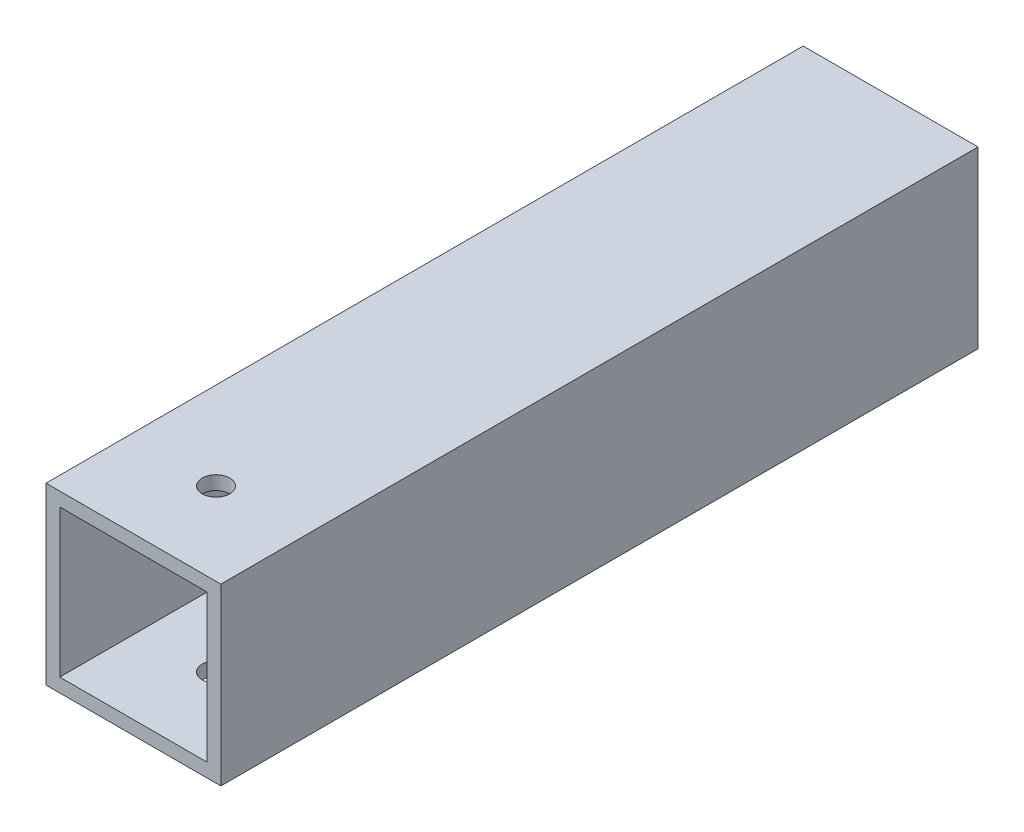
ISO-10303-21;
HEADER;
FILE_DESCRIPTION(('STEP AP214'),'2;1');
FILE_NAME('part.step','',(''),(''),'','','');
FILE_SCHEMA(('AUTOMOTIVE_DESIGN { 1 0 10303 214 1 1 1 1 }'));
ENDSEC;
DATA;
#1=APPLICATION_CONTEXT('core data for automotive mechanical design processes');
#2=APPLICATION_PROTOCOL_DEFINITION('international standard','automotive_design',2000,#1);
#3=PRODUCT_CONTEXT('',#1,'mechanical');
#4=PRODUCT('Part','Part','',(#3));
#5=PRODUCT_RELATED_PRODUCT_CATEGORY('part','',(#4));
#6=PRODUCT_DEFINITION_FORMATION('','',#4);
#7=PRODUCT_DEFINITION_CONTEXT('part definition',#1,'design');
#8=PRODUCT_DEFINITION('design','',#6,#7);
#9=PRODUCT_DEFINITION_SHAPE('','',#8);
#10=(LENGTH_UNIT() NAMED_UNIT(*) SI_UNIT(.MILLI.,.METRE.));
#11=(NAMED_UNIT(*) PLANE_ANGLE_UNIT() SI_UNIT($,.RADIAN.));
#12=(NAMED_UNIT(*) SI_UNIT($,.STERADIAN.) SOLID_ANGLE_UNIT());
#13=UNCERTAINTY_MEASURE_WITH_UNIT(LENGTH_MEASURE(1.E-05),#10,'distance_accuracy_value','');
#14=(GEOMETRIC_REPRESENTATION_CONTEXT(3) GLOBAL_UNCERTAINTY_ASSIGNED_CONTEXT((#13)) GLOBAL_UNIT_ASSIGNED_CONTEXT((#10,
#11,#12)) REPRESENTATION_CONTEXT('',''));
#15=CARTESIAN_POINT('',(0.,0.,0.));
#16=DIRECTION('',(0.,0.,1.));
#17=DIRECTION('',(1.,0.,0.));
#18=AXIS2_PLACEMENT_3D('',#15,#16,#17);
#19=CARTESIAN_POINT('',(0.,0.,110.));
#20=DIRECTION('',(0.,0.,-1.));
#21=DIRECTION('',(-1.,0.,0.));
#22=AXIS2_PLACEMENT_3D('',#19,#20,#21);
#23=PLANE('',#22);
#24=DIRECTION('',(0.,-1.,0.));
#25=VECTOR('',#24,1.);
#26=CARTESIAN_POINT('',(0.,0.,110.));
#27=LINE('',#26,#25);
#28=CARTESIAN_POINT('',(0.,25.4,110.));
#29=VERTEX_POINT('',#28);
#30=CARTESIAN_POINT('',(0.,0.,110.));
#31=VERTEX_POINT('',#30);
#32=EDGE_CURVE('E136',#29,#31,#27,.T.);
#33=ORIENTED_EDGE('',*,*,#32,.T.);
#34=DIRECTION('',(1.,0.,0.));
#35=VECTOR('',#34,1.);
#36=CARTESIAN_POINT('',(0.,0.,110.));
#37=LINE('',#36,#35);
#38=CARTESIAN_POINT('',(25.4,0.,110.));
#39=VERTEX_POINT('',#38);
#40=EDGE_CURVE('E139',#31,#39,#37,.T.);
#41=ORIENTED_EDGE('',*,*,#40,.T.);
#42=DIRECTION('',(0.,1.,0.));
#43=VECTOR('',#42,1.);
#44=CARTESIAN_POINT('',(25.4,0.,110.));
#45=LINE('',#44,#43);
#46=CARTESIAN_POINT('',(25.4,25.4,110.));
#47=VERTEX_POINT('',#46);
#48=EDGE_CURVE('E142',#39,#47,#45,.T.);
#49=ORIENTED_EDGE('',*,*,#48,.T.);
#50=DIRECTION('',(-1.,0.,0.));
#51=VECTOR('',#50,1.);
#52=CARTESIAN_POINT('',(0.,25.4,110.));
#53=LINE('',#52,#51);
#54=EDGE_CURVE('E144',#47,#29,#53,.T.);
#55=ORIENTED_EDGE('',*,*,#54,.T.);
#56=EDGE_LOOP('',(#33,#41,#49,#55));
#57=FACE_BOUND('',#56,.T.);
#58=DIRECTION('',(0.,-1.,0.));
#59=VECTOR('',#58,1.);
#60=CARTESIAN_POINT('',(2.,23.4,110.));
#61=LINE('',#60,#59);
#62=CARTESIAN_POINT('',(2.,23.4,110.));
#63=VERTEX_POINT('',#62);
#64=CARTESIAN_POINT('',(2.,2.,110.));
#65=VERTEX_POINT('',#64);
#66=EDGE_CURVE('E98',#63,#65,#61,.T.);
#67=ORIENTED_EDGE('',*,*,#66,.F.);
#68=DIRECTION('',(-1.,0.,0.));
#69=VECTOR('',#68,1.);
#70=CARTESIAN_POINT('',(2.,23.4,110.));
#71=LINE('',#70,#69);
#72=CARTESIAN_POINT('',(23.4,23.4,110.));
#73=VERTEX_POINT('',#72);
#74=EDGE_CURVE('E120',#73,#63,#71,.T.);
#75=ORIENTED_EDGE('',*,*,#74,.F.);
#76=DIRECTION('',(0.,1.,0.));
#77=VECTOR('',#76,1.);
#78=CARTESIAN_POINT('',(23.4,23.4,110.));
#79=LINE('',#78,#77);
#80=CARTESIAN_POINT('',(23.4,2.,110.));
#81=VERTEX_POINT('',#80);
#82=EDGE_CURVE('E118',#81,#73,#79,.T.);
#83=ORIENTED_EDGE('',*,*,#82,.F.);
#84=DIRECTION('',(1.,0.,0.));
#85=VECTOR('',#84,1.);
#86=CARTESIAN_POINT('',(2.,2.,110.));
#87=LINE('',#86,#85);
#88=EDGE_CURVE('E106',#65,#81,#87,.T.);
#89=ORIENTED_EDGE('',*,*,#88,.F.);
#90=EDGE_LOOP('',(#67,#75,#83,#89));
#91=FACE_BOUND('',#90,.T.);
#92=ADVANCED_FACE('F32',(#57,#91),#23,.F.);
#93=CARTESIAN_POINT('',(0.,0.,0.));
#94=DIRECTION('',(0.,0.,-1.));
#95=DIRECTION('',(-1.,0.,0.));
#96=AXIS2_PLACEMENT_3D('',#93,#94,#95);
#97=PLANE('',#96);
#98=DIRECTION('',(0.,-1.,0.));
#99=VECTOR('',#98,1.);
#100=CARTESIAN_POINT('',(0.,0.,0.));
#101=LINE('',#100,#99);
#102=CARTESIAN_POINT('',(0.,25.4,0.));
#103=VERTEX_POINT('',#102);
#104=CARTESIAN_POINT('',(0.,0.,0.));
#105=VERTEX_POINT('',#104);
#106=EDGE_CURVE('E114',#103,#105,#101,.T.);
#107=ORIENTED_EDGE('',*,*,#106,.F.);
#108=DIRECTION('',(-1.,0.,0.));
#109=VECTOR('',#108,1.);
#110=CARTESIAN_POINT('',(0.,25.4,0.));
#111=LINE('',#110,#109);
#112=CARTESIAN_POINT('',(25.4,25.4,0.));
#113=VERTEX_POINT('',#112);
#114=EDGE_CURVE('E140',#113,#103,#111,.T.);
#115=ORIENTED_EDGE('',*,*,#114,.F.);
#116=DIRECTION('',(0.,1.,0.));
#117=VECTOR('',#116,1.);
#118=CARTESIAN_POINT('',(25.4,0.,0.));
#119=LINE('',#118,#117);
#120=CARTESIAN_POINT('',(25.4,0.,0.));
#121=VERTEX_POINT('',#120);
#122=EDGE_CURVE('E151',#121,#113,#119,.T.);
#123=ORIENTED_EDGE('',*,*,#122,.F.);
#124=DIRECTION('',(1.,0.,0.));
#125=VECTOR('',#124,1.);
#126=CARTESIAN_POINT('',(0.,0.,0.));
#127=LINE('',#126,#125);
#128=EDGE_CURVE('E149',#105,#121,#127,.T.);
#129=ORIENTED_EDGE('',*,*,#128,.F.);
#130=EDGE_LOOP('',(#107,#115,#123,#129));
#131=FACE_BOUND('',#130,.T.);
#132=DIRECTION('',(-1.,0.,0.));
#133=VECTOR('',#132,1.);
#134=CARTESIAN_POINT('',(2.,23.4,0.));
#135=LINE('',#134,#133);
#136=CARTESIAN_POINT('',(23.4,23.4,0.));
#137=VERTEX_POINT('',#136);
#138=CARTESIAN_POINT('',(2.,23.4,0.));
#139=VERTEX_POINT('',#138);
#140=EDGE_CURVE('E107',#137,#139,#135,.T.);
#141=ORIENTED_EDGE('',*,*,#140,.T.);
#142=DIRECTION('',(0.,-1.,0.));
#143=VECTOR('',#142,1.);
#144=CARTESIAN_POINT('',(2.,23.4,0.));
#145=LINE('',#144,#143);
#146=CARTESIAN_POINT('',(2.,2.,0.));
#147=VERTEX_POINT('',#146);
#148=EDGE_CURVE('E56',#139,#147,#145,.T.);
#149=ORIENTED_EDGE('',*,*,#148,.T.);
#150=DIRECTION('',(1.,0.,0.));
#151=VECTOR('',#150,1.);
#152=CARTESIAN_POINT('',(2.,2.,0.));
#153=LINE('',#152,#151);
#154=CARTESIAN_POINT('',(23.4,2.,0.));
#155=VERTEX_POINT('',#154);
#156=EDGE_CURVE('E113',#147,#155,#153,.T.);
#157=ORIENTED_EDGE('',*,*,#156,.T.);
#158=DIRECTION('',(0.,1.,0.));
#159=VECTOR('',#158,1.);
#160=CARTESIAN_POINT('',(23.4,23.4,0.));
#161=LINE('',#160,#159);
#162=EDGE_CURVE('E128',#155,#137,#161,.T.);
#163=ORIENTED_EDGE('',*,*,#162,.T.);
#164=EDGE_LOOP('',(#141,#149,#157,#163));
#165=FACE_BOUND('',#164,.T.);
#166=ADVANCED_FACE('F170',(#131,#165),#97,.T.);
#167=CARTESIAN_POINT('',(0.,0.,110.));
#168=DIRECTION('',(1.,0.,0.));
#169=DIRECTION('',(0.,0.,-1.));
#170=AXIS2_PLACEMENT_3D('',#167,#168,#169);
#171=PLANE('',#170);
#172=ORIENTED_EDGE('',*,*,#106,.T.);
#173=DIRECTION('',(0.,0.,-1.));
#174=VECTOR('',#173,1.);
#175=CARTESIAN_POINT('',(0.,0.,110.));
#176=LINE('',#175,#174);
#177=EDGE_CURVE('E11',#31,#105,#176,.T.);
#178=ORIENTED_EDGE('',*,*,#177,.F.);
#179=ORIENTED_EDGE('',*,*,#32,.F.);
#180=DIRECTION('',(0.,0.,-1.));
#181=VECTOR('',#180,1.);
#182=CARTESIAN_POINT('',(0.,25.4,110.));
#183=LINE('',#182,#181);
#184=EDGE_CURVE('E146',#29,#103,#183,.T.);
#185=ORIENTED_EDGE('',*,*,#184,.T.);
#186=EDGE_LOOP('',(#172,#178,#179,#185));
#187=FACE_BOUND('',#186,.T.);
#188=ADVANCED_FACE('F34',(#187),#171,.F.);
#189=CARTESIAN_POINT('',(0.,0.,110.));
#190=DIRECTION('',(0.,1.,0.));
#191=DIRECTION('',(0.,0.,1.));
#192=AXIS2_PLACEMENT_3D('',#189,#190,#191);
#193=PLANE('',#192);
#194=CARTESIAN_POINT('',(12.7,0.,98.));
#195=DIRECTION('',(0.,-1.,0.));
#196=DIRECTION('',(0.,0.,-1.));
#197=AXIS2_PLACEMENT_3D('',#194,#195,#196);
#198=CIRCLE('',#197,2.);
#199=CARTESIAN_POINT('',(12.7,0.,96.));
#200=VERTEX_POINT('',#199);
#201=EDGE_CURVE('E207',#200,#200,#198,.T.);
#202=ORIENTED_EDGE('',*,*,#201,.F.);
#203=EDGE_LOOP('',(#202));
#204=FACE_BOUND('',#203,.T.);
#205=ORIENTED_EDGE('',*,*,#128,.T.);
#206=DIRECTION('',(0.,0.,-1.));
#207=VECTOR('',#206,1.);
#208=CARTESIAN_POINT('',(25.4,0.,110.));
#209=LINE('',#208,#207);
#210=EDGE_CURVE('E41',#39,#121,#209,.T.);
#211=ORIENTED_EDGE('',*,*,#210,.F.);
#212=ORIENTED_EDGE('',*,*,#40,.F.);
#213=ORIENTED_EDGE('',*,*,#177,.T.);
#214=EDGE_LOOP('',(#205,#211,#212,#213));
#215=FACE_BOUND('',#214,.T.);
#216=ADVANCED_FACE('F180',(#204,#215),#193,.F.);
#217=CARTESIAN_POINT('',(25.4,0.,110.));
#218=DIRECTION('',(-1.,0.,0.));
#219=DIRECTION('',(0.,0.,1.));
#220=AXIS2_PLACEMENT_3D('',#217,#218,#219);
#221=PLANE('',#220);
#222=ORIENTED_EDGE('',*,*,#122,.T.);
#223=DIRECTION('',(0.,0.,-1.));
#224=VECTOR('',#223,1.);
#225=CARTESIAN_POINT('',(25.4,25.4,110.));
#226=LINE('',#225,#224);
#227=EDGE_CURVE('E156',#47,#113,#226,.T.);
#228=ORIENTED_EDGE('',*,*,#227,.F.);
#229=ORIENTED_EDGE('',*,*,#48,.F.);
#230=ORIENTED_EDGE('',*,*,#210,.T.);
#231=EDGE_LOOP('',(#222,#228,#229,#230));
#232=FACE_BOUND('',#231,.T.);
#233=ADVANCED_FACE('F164',(#232),#221,.F.);
#234=CARTESIAN_POINT('',(0.,25.4,110.));
#235=DIRECTION('',(0.,-1.,0.));
#236=DIRECTION('',(0.,0.,-1.));
#237=AXIS2_PLACEMENT_3D('',#234,#235,#236);
#238=PLANE('',#237);
#239=CARTESIAN_POINT('',(12.7,25.4,98.));
#240=DIRECTION('',(0.,-1.,0.));
#241=DIRECTION('',(0.,0.,-1.));
#242=AXIS2_PLACEMENT_3D('',#239,#240,#241);
#243=CIRCLE('',#242,2.);
#244=CARTESIAN_POINT('',(12.7,25.4,96.));
#245=VERTEX_POINT('',#244);
#246=EDGE_CURVE('E205',#245,#245,#243,.T.);
#247=ORIENTED_EDGE('',*,*,#246,.T.);
#248=EDGE_LOOP('',(#247));
#249=FACE_BOUND('',#248,.T.);
#250=ORIENTED_EDGE('',*,*,#114,.T.);
#251=ORIENTED_EDGE('',*,*,#184,.F.);
#252=ORIENTED_EDGE('',*,*,#54,.F.);
#253=ORIENTED_EDGE('',*,*,#227,.T.);
#254=EDGE_LOOP('',(#250,#251,#252,#253));
#255=FACE_BOUND('',#254,.T.);
#256=ADVANCED_FACE('F174',(#249,#255),#238,.F.);
#257=CARTESIAN_POINT('',(2.,23.4,110.));
#258=DIRECTION('',(1.,0.,0.));
#259=DIRECTION('',(0.,1.,0.));
#260=AXIS2_PLACEMENT_3D('',#257,#258,#259);
#261=PLANE('',#260);
#262=ORIENTED_EDGE('',*,*,#148,.F.);
#263=DIRECTION('',(0.,0.,-1.));
#264=VECTOR('',#263,1.);
#265=CARTESIAN_POINT('',(2.,23.4,110.));
#266=LINE('',#265,#264);
#267=EDGE_CURVE('E102',#63,#139,#266,.T.);
#268=ORIENTED_EDGE('',*,*,#267,.F.);
#269=ORIENTED_EDGE('',*,*,#66,.T.);
#270=DIRECTION('',(0.,0.,-1.));
#271=VECTOR('',#270,1.);
#272=CARTESIAN_POINT('',(2.,2.,110.));
#273=LINE('',#272,#271);
#274=EDGE_CURVE('E101',#65,#147,#273,.T.);
#275=ORIENTED_EDGE('',*,*,#274,.T.);
#276=EDGE_LOOP('',(#262,#268,#269,#275));
#277=FACE_BOUND('',#276,.T.);
#278=ADVANCED_FACE('F100',(#277),#261,.T.);
#279=CARTESIAN_POINT('',(2.,2.,110.));
#280=DIRECTION('',(0.,1.,0.));
#281=DIRECTION('',(0.,0.,1.));
#282=AXIS2_PLACEMENT_3D('',#279,#280,#281);
#283=PLANE('',#282);
#284=CARTESIAN_POINT('',(12.7,2.,98.));
#285=DIRECTION('',(0.,1.,0.));
#286=DIRECTION('',(0.,0.,1.));
#287=AXIS2_PLACEMENT_3D('',#284,#285,#286);
#288=CIRCLE('',#287,2.);
#289=CARTESIAN_POINT('',(12.7,2.,100.));
#290=VERTEX_POINT('',#289);
#291=EDGE_CURVE('E126',#290,#290,#288,.T.);
#292=ORIENTED_EDGE('',*,*,#291,.F.);
#293=EDGE_LOOP('',(#292));
#294=FACE_BOUND('',#293,.T.);
#295=ORIENTED_EDGE('',*,*,#156,.F.);
#296=ORIENTED_EDGE('',*,*,#274,.F.);
#297=ORIENTED_EDGE('',*,*,#88,.T.);
#298=DIRECTION('',(0.,0.,-1.));
#299=VECTOR('',#298,1.);
#300=CARTESIAN_POINT('',(23.4,2.,110.));
#301=LINE('',#300,#299);
#302=EDGE_CURVE('E115',#81,#155,#301,.T.);
#303=ORIENTED_EDGE('',*,*,#302,.T.);
#304=EDGE_LOOP('',(#295,#296,#297,#303));
#305=FACE_BOUND('',#304,.T.);
#306=ADVANCED_FACE('F110',(#294,#305),#283,.T.);
#307=CARTESIAN_POINT('',(23.4,23.4,110.));
#308=DIRECTION('',(-1.,0.,0.));
#309=DIRECTION('',(0.,-1.,0.));
#310=AXIS2_PLACEMENT_3D('',#307,#308,#309);
#311=PLANE('',#310);
#312=ORIENTED_EDGE('',*,*,#162,.F.);
#313=ORIENTED_EDGE('',*,*,#302,.F.);
#314=ORIENTED_EDGE('',*,*,#82,.T.);
#315=DIRECTION('',(0.,0.,-1.));
#316=VECTOR('',#315,1.);
#317=CARTESIAN_POINT('',(23.4,23.4,110.));
#318=LINE('',#317,#316);
#319=EDGE_CURVE('E48',#73,#137,#318,.T.);
#320=ORIENTED_EDGE('',*,*,#319,.T.);
#321=EDGE_LOOP('',(#312,#313,#314,#320));
#322=FACE_BOUND('',#321,.T.);
#323=ADVANCED_FACE('F219',(#322),#311,.T.);
#324=CARTESIAN_POINT('',(2.,23.4,110.));
#325=DIRECTION('',(0.,-1.,0.));
#326=DIRECTION('',(0.,0.,-1.));
#327=AXIS2_PLACEMENT_3D('',#324,#325,#326);
#328=PLANE('',#327);
#329=CARTESIAN_POINT('',(12.7,23.4,98.));
#330=DIRECTION('',(0.,-1.,0.));
#331=DIRECTION('',(0.,0.,-1.));
#332=AXIS2_PLACEMENT_3D('',#329,#330,#331);
#333=CIRCLE('',#332,2.);
#334=CARTESIAN_POINT('',(12.7,23.4,96.));
#335=VERTEX_POINT('',#334);
#336=EDGE_CURVE('E36',#335,#335,#333,.T.);
#337=ORIENTED_EDGE('',*,*,#336,.F.);
#338=EDGE_LOOP('',(#337));
#339=FACE_BOUND('',#338,.T.);
#340=ORIENTED_EDGE('',*,*,#140,.F.);
#341=ORIENTED_EDGE('',*,*,#319,.F.);
#342=ORIENTED_EDGE('',*,*,#74,.T.);
#343=ORIENTED_EDGE('',*,*,#267,.T.);
#344=EDGE_LOOP('',(#340,#341,#342,#343));
#345=FACE_BOUND('',#344,.T.);
#346=ADVANCED_FACE('F223',(#339,#345),#328,.T.);
#347=CARTESIAN_POINT('',(12.7,25.4,98.));
#348=DIRECTION('',(0.,-1.,0.));
#349=DIRECTION('',(0.,0.,-1.));
#350=AXIS2_PLACEMENT_3D('',#347,#348,#349);
#351=CYLINDRICAL_SURFACE('',#350,2.);
#352=ORIENTED_EDGE('',*,*,#336,.T.);
#353=EDGE_LOOP('',(#352));
#354=FACE_BOUND('',#353,.T.);
#355=ORIENTED_EDGE('',*,*,#246,.F.);
#356=EDGE_LOOP('',(#355));
#357=FACE_BOUND('',#356,.T.);
#358=ADVANCED_FACE('F229',(#354,#357),#351,.F.);
#359=ORIENTED_EDGE('',*,*,#291,.T.);
#360=EDGE_LOOP('',(#359));
#361=FACE_BOUND('',#360,.T.);
#362=ORIENTED_EDGE('',*,*,#201,.T.);
#363=EDGE_LOOP('',(#362));
#364=FACE_BOUND('',#363,.T.);
#365=ADVANCED_FACE('F215',(#361,#364),#351,.F.);
#366=CLOSED_SHELL('',(#92,#166,#188,#216,#233,#256,#278,#306,#323,#346,#358,#365));
#367=MANIFOLD_SOLID_BREP('B2',#366);
#368=ADVANCED_BREP_SHAPE_REPRESENTATION('',(#18,#367),#14);
#369=SHAPE_DEFINITION_REPRESENTATION(#9,#368);
ENDSEC;
END-ISO-10303-21;
